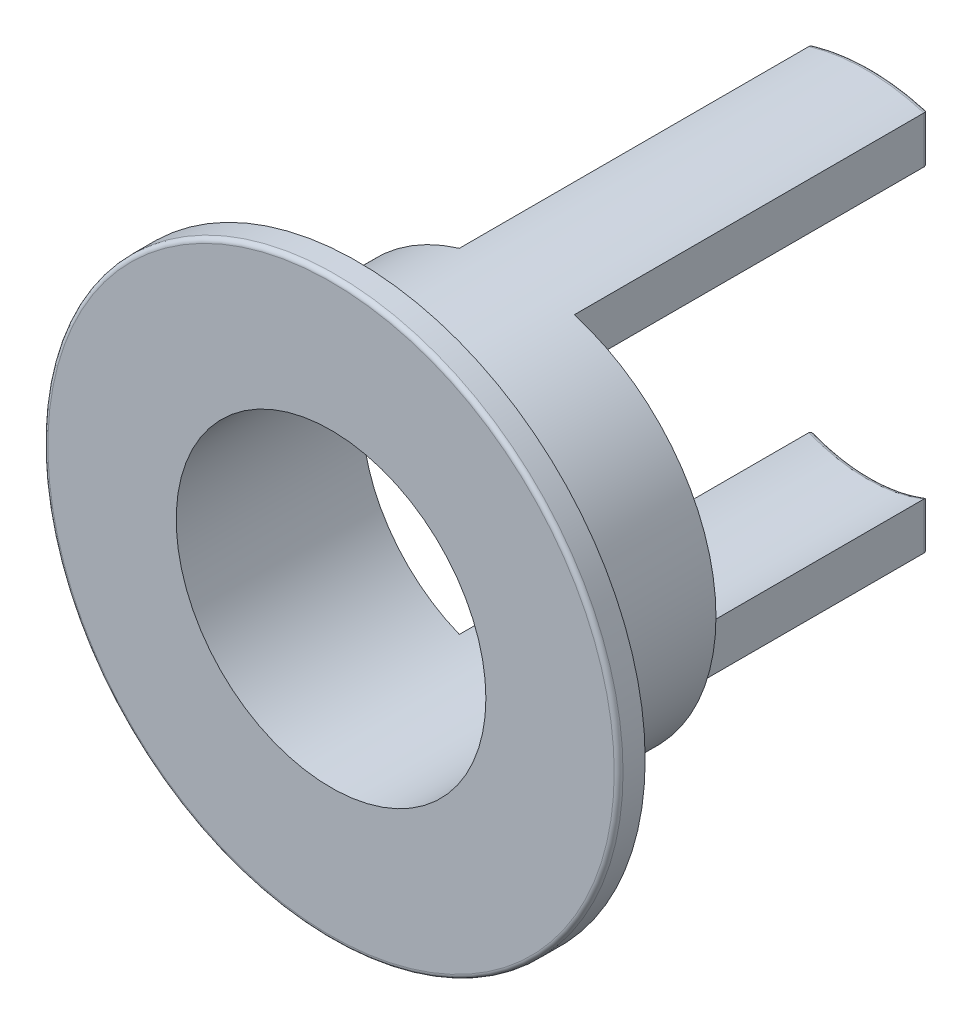
ISO-10303-21;
HEADER;
FILE_DESCRIPTION(('STEP AP214'),'2;1');
FILE_NAME('part.step','',(''),(''),'','','');
FILE_SCHEMA(('AUTOMOTIVE_DESIGN { 1 0 10303 214 1 1 1 1 }'));
ENDSEC;
DATA;
#1=APPLICATION_CONTEXT('core data for automotive mechanical design processes');
#2=APPLICATION_PROTOCOL_DEFINITION('international standard','automotive_design',2000,#1);
#3=PRODUCT_CONTEXT('',#1,'mechanical');
#4=PRODUCT('Part','Part','',(#3));
#5=PRODUCT_RELATED_PRODUCT_CATEGORY('part','',(#4));
#6=PRODUCT_DEFINITION_FORMATION('','',#4);
#7=PRODUCT_DEFINITION_CONTEXT('part definition',#1,'design');
#8=PRODUCT_DEFINITION('design','',#6,#7);
#9=PRODUCT_DEFINITION_SHAPE('','',#8);
#10=(LENGTH_UNIT() NAMED_UNIT(*) SI_UNIT(.MILLI.,.METRE.));
#11=(NAMED_UNIT(*) PLANE_ANGLE_UNIT() SI_UNIT($,.RADIAN.));
#12=(NAMED_UNIT(*) SI_UNIT($,.STERADIAN.) SOLID_ANGLE_UNIT());
#13=UNCERTAINTY_MEASURE_WITH_UNIT(LENGTH_MEASURE(1.E-05),#10,'distance_accuracy_value','');
#14=(GEOMETRIC_REPRESENTATION_CONTEXT(3) GLOBAL_UNCERTAINTY_ASSIGNED_CONTEXT((#13)) GLOBAL_UNIT_ASSIGNED_CONTEXT((#10,
#11,#12)) REPRESENTATION_CONTEXT('',''));
#15=CARTESIAN_POINT('',(0.,0.,0.));
#16=DIRECTION('',(0.,0.,1.));
#17=DIRECTION('',(1.,0.,0.));
#18=AXIS2_PLACEMENT_3D('',#15,#16,#17);
#19=CARTESIAN_POINT('',(0.,0.,0.3));
#20=DIRECTION('',(0.,0.,-1.));
#21=DIRECTION('',(-1.,0.,0.));
#22=AXIS2_PLACEMENT_3D('',#19,#20,#21);
#23=CYLINDRICAL_SURFACE('',#22,1.75);
#24=CARTESIAN_POINT('',(0.,0.,0.3));
#25=DIRECTION('',(0.,0.,1.));
#26=DIRECTION('',(1.,0.,0.));
#27=AXIS2_PLACEMENT_3D('',#24,#25,#26);
#28=CIRCLE('',#27,1.75);
#29=CARTESIAN_POINT('',(1.75,0.,0.3));
#30=VERTEX_POINT('',#29);
#31=EDGE_CURVE('E192',#30,#30,#28,.T.);
#32=ORIENTED_EDGE('',*,*,#31,.T.);
#33=EDGE_LOOP('',(#32));
#34=FACE_BOUND('',#33,.T.);
#35=DIRECTION('',(0.,0.,-1.));
#36=VECTOR('',#35,1.);
#37=CARTESIAN_POINT('',(0.65,-1.62480768092719,4.59565011723042));
#38=LINE('',#37,#36);
#39=CARTESIAN_POINT('',(0.65,-1.62480768092719,-1.8));
#40=VERTEX_POINT('',#39);
#41=CARTESIAN_POINT('',(0.65,-1.62480768092719,-5.75));
#42=VERTEX_POINT('',#41);
#43=EDGE_CURVE('E169',#40,#42,#38,.T.);
#44=ORIENTED_EDGE('',*,*,#43,.T.);
#45=CARTESIAN_POINT('',(0.,0.,-5.75));
#46=DIRECTION('',(0.,0.,1.));
#47=DIRECTION('',(1.,0.,0.));
#48=AXIS2_PLACEMENT_3D('',#45,#46,#47);
#49=CIRCLE('',#48,1.75);
#50=CARTESIAN_POINT('',(-0.65,-1.62480768092719,-5.75));
#51=VERTEX_POINT('',#50);
#52=EDGE_CURVE('E227',#42,#51,#49,.F.);
#53=ORIENTED_EDGE('',*,*,#52,.T.);
#54=DIRECTION('',(0.,0.,-1.));
#55=VECTOR('',#54,1.);
#56=CARTESIAN_POINT('',(-0.65,-1.62480768092719,4.59565011723042));
#57=LINE('',#56,#55);
#58=CARTESIAN_POINT('',(-0.65,-1.62480768092719,-1.8));
#59=VERTEX_POINT('',#58);
#60=EDGE_CURVE('E166',#59,#51,#57,.T.);
#61=ORIENTED_EDGE('',*,*,#60,.F.);
#62=CARTESIAN_POINT('',(0.,0.,-1.8));
#63=DIRECTION('',(0.,0.,1.));
#64=DIRECTION('',(1.,0.,0.));
#65=AXIS2_PLACEMENT_3D('',#62,#63,#64);
#66=CIRCLE('',#65,1.75);
#67=CARTESIAN_POINT('',(-0.65,1.62480768092719,-1.8));
#68=VERTEX_POINT('',#67);
#69=EDGE_CURVE('E159',#68,#59,#66,.T.);
#70=ORIENTED_EDGE('',*,*,#69,.F.);
#71=DIRECTION('',(0.,0.,-1.));
#72=VECTOR('',#71,1.);
#73=CARTESIAN_POINT('',(-0.65,1.62480768092719,4.59565011723042));
#74=LINE('',#73,#72);
#75=CARTESIAN_POINT('',(-0.65,1.62480768092719,-5.75));
#76=VERTEX_POINT('',#75);
#77=EDGE_CURVE('E142',#68,#76,#74,.T.);
#78=ORIENTED_EDGE('',*,*,#77,.T.);
#79=CARTESIAN_POINT('',(0.,0.,-5.75));
#80=DIRECTION('',(0.,0.,1.));
#81=DIRECTION('',(1.,0.,0.));
#82=AXIS2_PLACEMENT_3D('',#79,#80,#81);
#83=CIRCLE('',#82,1.75);
#84=CARTESIAN_POINT('',(0.65,1.62480768092719,-5.75));
#85=VERTEX_POINT('',#84);
#86=EDGE_CURVE('E67',#76,#85,#83,.F.);
#87=ORIENTED_EDGE('',*,*,#86,.T.);
#88=DIRECTION('',(0.,0.,-1.));
#89=VECTOR('',#88,1.);
#90=CARTESIAN_POINT('',(0.65,1.62480768092719,4.59565011723042));
#91=LINE('',#90,#89);
#92=CARTESIAN_POINT('',(0.65,1.62480768092719,-1.8));
#93=VERTEX_POINT('',#92);
#94=EDGE_CURVE('E178',#93,#85,#91,.T.);
#95=ORIENTED_EDGE('',*,*,#94,.F.);
#96=CARTESIAN_POINT('',(0.,0.,-1.8));
#97=DIRECTION('',(0.,0.,1.));
#98=DIRECTION('',(1.,0.,0.));
#99=AXIS2_PLACEMENT_3D('',#96,#97,#98);
#100=CIRCLE('',#99,1.75);
#101=EDGE_CURVE('E179',#40,#93,#100,.T.);
#102=ORIENTED_EDGE('',*,*,#101,.F.);
#103=EDGE_LOOP('',(#44,#53,#61,#70,#78,#87,#95,#102));
#104=FACE_BOUND('',#103,.T.);
#105=ADVANCED_FACE('F38',(#34,#104),#23,.F.);
#106=CARTESIAN_POINT('',(0.,0.,-5.8));
#107=DIRECTION('',(0.,0.,1.));
#108=DIRECTION('',(1.,0.,0.));
#109=AXIS2_PLACEMENT_3D('',#106,#107,#108);
#110=CYLINDRICAL_SURFACE('',#109,2.25);
#111=CARTESIAN_POINT('',(0.,0.,0.));
#112=DIRECTION('',(0.,0.,1.));
#113=DIRECTION('',(1.,0.,0.));
#114=AXIS2_PLACEMENT_3D('',#111,#112,#113);
#115=CIRCLE('',#114,2.25);
#116=CARTESIAN_POINT('',(2.25,0.,0.));
#117=VERTEX_POINT('',#116);
#118=EDGE_CURVE('E188',#117,#117,#115,.T.);
#119=ORIENTED_EDGE('',*,*,#118,.F.);
#120=EDGE_LOOP('',(#119));
#121=FACE_BOUND('',#120,.T.);
#122=DIRECTION('',(0.,0.,-1.));
#123=VECTOR('',#122,1.);
#124=CARTESIAN_POINT('',(-0.65,-2.1540659228538,4.59565011723042));
#125=LINE('',#124,#123);
#126=CARTESIAN_POINT('',(-0.65,-2.1540659228538,-1.8));
#127=VERTEX_POINT('',#126);
#128=CARTESIAN_POINT('',(-0.65,-2.1540659228538,-5.75));
#129=VERTEX_POINT('',#128);
#130=EDGE_CURVE('E163',#127,#129,#125,.T.);
#131=ORIENTED_EDGE('',*,*,#130,.T.);
#132=CARTESIAN_POINT('',(0.,0.,-5.75));
#133=DIRECTION('',(0.,0.,1.));
#134=DIRECTION('',(1.,0.,0.));
#135=AXIS2_PLACEMENT_3D('',#132,#133,#134);
#136=CIRCLE('',#135,2.25);
#137=CARTESIAN_POINT('',(0.65,-2.1540659228538,-5.75));
#138=VERTEX_POINT('',#137);
#139=EDGE_CURVE('E224',#129,#138,#136,.T.);
#140=ORIENTED_EDGE('',*,*,#139,.T.);
#141=DIRECTION('',(0.,0.,-1.));
#142=VECTOR('',#141,1.);
#143=CARTESIAN_POINT('',(0.65,-2.1540659228538,4.59565011723042));
#144=LINE('',#143,#142);
#145=CARTESIAN_POINT('',(0.65,-2.1540659228538,-1.8));
#146=VERTEX_POINT('',#145);
#147=EDGE_CURVE('E173',#146,#138,#144,.T.);
#148=ORIENTED_EDGE('',*,*,#147,.F.);
#149=CARTESIAN_POINT('',(0.,0.,-1.8));
#150=DIRECTION('',(0.,0.,1.));
#151=DIRECTION('',(1.,0.,0.));
#152=AXIS2_PLACEMENT_3D('',#149,#150,#151);
#153=CIRCLE('',#152,2.25);
#154=CARTESIAN_POINT('',(0.65,2.1540659228538,-1.8));
#155=VERTEX_POINT('',#154);
#156=EDGE_CURVE('E170',#155,#146,#153,.F.);
#157=ORIENTED_EDGE('',*,*,#156,.F.);
#158=DIRECTION('',(0.,0.,-1.));
#159=VECTOR('',#158,1.);
#160=CARTESIAN_POINT('',(0.65,2.1540659228538,4.59565011723042));
#161=LINE('',#160,#159);
#162=CARTESIAN_POINT('',(0.65,2.1540659228538,-5.75));
#163=VERTEX_POINT('',#162);
#164=EDGE_CURVE('E174',#155,#163,#161,.T.);
#165=ORIENTED_EDGE('',*,*,#164,.T.);
#166=CARTESIAN_POINT('',(0.,0.,-5.75));
#167=DIRECTION('',(0.,0.,1.));
#168=DIRECTION('',(1.,0.,0.));
#169=AXIS2_PLACEMENT_3D('',#166,#167,#168);
#170=CIRCLE('',#169,2.25);
#171=CARTESIAN_POINT('',(-0.65,2.1540659228538,-5.75));
#172=VERTEX_POINT('',#171);
#173=EDGE_CURVE('E157',#163,#172,#170,.T.);
#174=ORIENTED_EDGE('',*,*,#173,.T.);
#175=DIRECTION('',(0.,0.,-1.));
#176=VECTOR('',#175,1.);
#177=CARTESIAN_POINT('',(-0.65,2.1540659228538,4.59565011723042));
#178=LINE('',#177,#176);
#179=CARTESIAN_POINT('',(-0.65,2.1540659228538,-1.8));
#180=VERTEX_POINT('',#179);
#181=EDGE_CURVE('E140',#180,#172,#178,.T.);
#182=ORIENTED_EDGE('',*,*,#181,.F.);
#183=CARTESIAN_POINT('',(0.,0.,-1.8));
#184=DIRECTION('',(0.,0.,1.));
#185=DIRECTION('',(1.,0.,0.));
#186=AXIS2_PLACEMENT_3D('',#183,#184,#185);
#187=CIRCLE('',#186,2.25);
#188=EDGE_CURVE('E146',#127,#180,#187,.F.);
#189=ORIENTED_EDGE('',*,*,#188,.F.);
#190=EDGE_LOOP('',(#131,#140,#148,#157,#165,#174,#182,#189));
#191=FACE_BOUND('',#190,.T.);
#192=ADVANCED_FACE('F155',(#121,#191),#110,.T.);
#193=CARTESIAN_POINT('',(0.,0.,-5.8));
#194=DIRECTION('',(0.,0.,1.));
#195=DIRECTION('',(1.,0.,0.));
#196=AXIS2_PLACEMENT_3D('',#193,#194,#195);
#197=PLANE('',#196);
#198=DIRECTION('',(0.,1.,0.));
#199=VECTOR('',#198,1.);
#200=CARTESIAN_POINT('',(0.6,0.,-5.8));
#201=LINE('',#200,#199);
#202=CARTESIAN_POINT('',(0.6,2.11660104885167,-5.8));
#203=VERTEX_POINT('',#202);
#204=CARTESIAN_POINT('',(0.6,1.69705627484771,-5.8));
#205=VERTEX_POINT('',#204);
#206=EDGE_CURVE('E213',#203,#205,#201,.F.);
#207=ORIENTED_EDGE('',*,*,#206,.T.);
#208=CARTESIAN_POINT('',(0.,0.,-5.8));
#209=DIRECTION('',(0.,0.,1.));
#210=DIRECTION('',(1.,0.,0.));
#211=AXIS2_PLACEMENT_3D('',#208,#209,#210);
#212=CIRCLE('',#211,1.8);
#213=CARTESIAN_POINT('',(-0.6,1.69705627484771,-5.8));
#214=VERTEX_POINT('',#213);
#215=EDGE_CURVE('E218',#205,#214,#212,.T.);
#216=ORIENTED_EDGE('',*,*,#215,.T.);
#217=DIRECTION('',(0.,1.,0.));
#218=VECTOR('',#217,1.);
#219=CARTESIAN_POINT('',(-0.6,2.1540659228538,-5.8));
#220=LINE('',#219,#218);
#221=CARTESIAN_POINT('',(-0.6,2.11660104885167,-5.8));
#222=VERTEX_POINT('',#221);
#223=EDGE_CURVE('E215',#214,#222,#220,.T.);
#224=ORIENTED_EDGE('',*,*,#223,.T.);
#225=CARTESIAN_POINT('',(0.,0.,-5.8));
#226=DIRECTION('',(0.,0.,1.));
#227=DIRECTION('',(1.,0.,0.));
#228=AXIS2_PLACEMENT_3D('',#225,#226,#227);
#229=CIRCLE('',#228,2.2);
#230=EDGE_CURVE('E211',#222,#203,#229,.F.);
#231=ORIENTED_EDGE('',*,*,#230,.T.);
#232=EDGE_LOOP('',(#207,#216,#224,#231));
#233=FACE_BOUND('',#232,.T.);
#234=ADVANCED_FACE('F312',(#233),#197,.F.);
#235=DIRECTION('',(0.,1.,0.));
#236=VECTOR('',#235,1.);
#237=CARTESIAN_POINT('',(0.6,0.,-5.8));
#238=LINE('',#237,#236);
#239=CARTESIAN_POINT('',(0.6,-1.69705627484771,-5.8));
#240=VERTEX_POINT('',#239);
#241=CARTESIAN_POINT('',(0.6,-2.11660104885167,-5.8));
#242=VERTEX_POINT('',#241);
#243=EDGE_CURVE('E204',#240,#242,#238,.F.);
#244=ORIENTED_EDGE('',*,*,#243,.T.);
#245=CARTESIAN_POINT('',(0.,0.,-5.8));
#246=DIRECTION('',(0.,0.,1.));
#247=DIRECTION('',(1.,0.,0.));
#248=AXIS2_PLACEMENT_3D('',#245,#246,#247);
#249=CIRCLE('',#248,2.2);
#250=CARTESIAN_POINT('',(-0.6,-2.11660104885167,-5.8));
#251=VERTEX_POINT('',#250);
#252=EDGE_CURVE('E207',#242,#251,#249,.F.);
#253=ORIENTED_EDGE('',*,*,#252,.T.);
#254=DIRECTION('',(0.,1.,0.));
#255=VECTOR('',#254,1.);
#256=CARTESIAN_POINT('',(-0.6,-1.62480768092719,-5.8));
#257=LINE('',#256,#255);
#258=CARTESIAN_POINT('',(-0.6,-1.69705627484771,-5.8));
#259=VERTEX_POINT('',#258);
#260=EDGE_CURVE('E202',#251,#259,#257,.T.);
#261=ORIENTED_EDGE('',*,*,#260,.T.);
#262=CARTESIAN_POINT('',(0.,0.,-5.8));
#263=DIRECTION('',(0.,0.,1.));
#264=DIRECTION('',(1.,0.,0.));
#265=AXIS2_PLACEMENT_3D('',#262,#263,#264);
#266=CIRCLE('',#265,1.8);
#267=EDGE_CURVE('E200',#259,#240,#266,.T.);
#268=ORIENTED_EDGE('',*,*,#267,.T.);
#269=EDGE_LOOP('',(#244,#253,#261,#268));
#270=FACE_BOUND('',#269,.T.);
#271=ADVANCED_FACE('F321',(#270),#197,.F.);
#272=CARTESIAN_POINT('',(0.,0.,0.3));
#273=DIRECTION('',(0.,0.,-1.));
#274=DIRECTION('',(-1.,0.,0.));
#275=AXIS2_PLACEMENT_3D('',#272,#273,#274);
#276=CYLINDRICAL_SURFACE('',#275,3.25);
#277=CARTESIAN_POINT('',(0.,0.,0.25));
#278=DIRECTION('',(0.,0.,1.));
#279=DIRECTION('',(1.,0.,0.));
#280=AXIS2_PLACEMENT_3D('',#277,#278,#279);
#281=CIRCLE('',#280,3.25);
#282=CARTESIAN_POINT('',(3.25,0.,0.25));
#283=VERTEX_POINT('',#282);
#284=EDGE_CURVE('E13',#283,#283,#281,.F.);
#285=ORIENTED_EDGE('',*,*,#284,.T.);
#286=EDGE_LOOP('',(#285));
#287=FACE_BOUND('',#286,.T.);
#288=CARTESIAN_POINT('',(0.,0.,0.));
#289=DIRECTION('',(0.,0.,1.));
#290=DIRECTION('',(1.,0.,0.));
#291=AXIS2_PLACEMENT_3D('',#288,#289,#290);
#292=CIRCLE('',#291,3.25);
#293=CARTESIAN_POINT('',(3.25,0.,0.));
#294=VERTEX_POINT('',#293);
#295=EDGE_CURVE('E191',#294,#294,#292,.T.);
#296=ORIENTED_EDGE('',*,*,#295,.T.);
#297=EDGE_LOOP('',(#296));
#298=FACE_BOUND('',#297,.T.);
#299=ADVANCED_FACE('F318',(#287,#298),#276,.T.);
#300=CARTESIAN_POINT('',(0.,0.,0.3));
#301=DIRECTION('',(0.,0.,1.));
#302=DIRECTION('',(1.,0.,0.));
#303=AXIS2_PLACEMENT_3D('',#300,#301,#302);
#304=PLANE('',#303);
#305=CARTESIAN_POINT('',(0.,0.,0.3));
#306=DIRECTION('',(0.,0.,1.));
#307=DIRECTION('',(1.,0.,0.));
#308=AXIS2_PLACEMENT_3D('',#305,#306,#307);
#309=CIRCLE('',#308,3.2);
#310=CARTESIAN_POINT('',(3.2,0.,0.3));
#311=VERTEX_POINT('',#310);
#312=EDGE_CURVE('E51',#311,#311,#309,.T.);
#313=ORIENTED_EDGE('',*,*,#312,.T.);
#314=EDGE_LOOP('',(#313));
#315=FACE_BOUND('',#314,.T.);
#316=ORIENTED_EDGE('',*,*,#31,.F.);
#317=EDGE_LOOP('',(#316));
#318=FACE_BOUND('',#317,.T.);
#319=ADVANCED_FACE('F320',(#315,#318),#304,.T.);
#320=CARTESIAN_POINT('',(0.,0.,0.));
#321=DIRECTION('',(0.,0.,1.));
#322=DIRECTION('',(1.,0.,0.));
#323=AXIS2_PLACEMENT_3D('',#320,#321,#322);
#324=PLANE('',#323);
#325=ORIENTED_EDGE('',*,*,#118,.T.);
#326=EDGE_LOOP('',(#325));
#327=FACE_BOUND('',#326,.T.);
#328=ORIENTED_EDGE('',*,*,#295,.F.);
#329=EDGE_LOOP('',(#328));
#330=FACE_BOUND('',#329,.T.);
#331=ADVANCED_FACE('F316',(#327,#330),#324,.F.);
#332=CARTESIAN_POINT('',(0.,0.,-1.8));
#333=DIRECTION('',(0.,0.,1.));
#334=DIRECTION('',(1.,0.,0.));
#335=AXIS2_PLACEMENT_3D('',#332,#333,#334);
#336=PLANE('',#335);
#337=ORIENTED_EDGE('',*,*,#156,.T.);
#338=DIRECTION('',(0.,1.,0.));
#339=VECTOR('',#338,1.);
#340=CARTESIAN_POINT('',(0.65,0.,-1.8));
#341=LINE('',#340,#339);
#342=EDGE_CURVE('E165',#146,#40,#341,.T.);
#343=ORIENTED_EDGE('',*,*,#342,.T.);
#344=ORIENTED_EDGE('',*,*,#101,.T.);
#345=DIRECTION('',(0.,1.,0.));
#346=VECTOR('',#345,1.);
#347=CARTESIAN_POINT('',(0.65,0.,-1.8));
#348=LINE('',#347,#346);
#349=EDGE_CURVE('E175',#93,#155,#348,.T.);
#350=ORIENTED_EDGE('',*,*,#349,.T.);
#351=EDGE_LOOP('',(#337,#343,#344,#350));
#352=FACE_BOUND('',#351,.T.);
#353=ADVANCED_FACE('F335',(#352),#336,.F.);
#354=CARTESIAN_POINT('',(0.65,0.,4.59565011723042));
#355=DIRECTION('',(-1.,0.,0.));
#356=DIRECTION('',(0.,0.,1.));
#357=AXIS2_PLACEMENT_3D('',#354,#355,#356);
#358=PLANE('',#357);
#359=ORIENTED_EDGE('',*,*,#147,.T.);
#360=DIRECTION('',(0.,1.,0.));
#361=VECTOR('',#360,1.);
#362=CARTESIAN_POINT('',(0.65,0.,-5.75));
#363=LINE('',#362,#361);
#364=EDGE_CURVE('E195',#138,#42,#363,.T.);
#365=ORIENTED_EDGE('',*,*,#364,.T.);
#366=ORIENTED_EDGE('',*,*,#43,.F.);
#367=ORIENTED_EDGE('',*,*,#342,.F.);
#368=EDGE_LOOP('',(#359,#365,#366,#367));
#369=FACE_BOUND('',#368,.T.);
#370=ADVANCED_FACE('F340',(#369),#358,.F.);
#371=ORIENTED_EDGE('',*,*,#94,.T.);
#372=DIRECTION('',(0.,1.,0.));
#373=VECTOR('',#372,1.);
#374=CARTESIAN_POINT('',(0.65,0.,-5.75));
#375=LINE('',#374,#373);
#376=EDGE_CURVE('E59',#85,#163,#375,.T.);
#377=ORIENTED_EDGE('',*,*,#376,.T.);
#378=ORIENTED_EDGE('',*,*,#164,.F.);
#379=ORIENTED_EDGE('',*,*,#349,.F.);
#380=EDGE_LOOP('',(#371,#377,#378,#379));
#381=FACE_BOUND('',#380,.T.);
#382=ADVANCED_FACE('F347',(#381),#358,.F.);
#383=CARTESIAN_POINT('',(0.,0.,-1.8));
#384=DIRECTION('',(0.,0.,1.));
#385=DIRECTION('',(1.,0.,0.));
#386=AXIS2_PLACEMENT_3D('',#383,#384,#385);
#387=PLANE('',#386);
#388=ORIENTED_EDGE('',*,*,#188,.T.);
#389=DIRECTION('',(0.,1.,0.));
#390=VECTOR('',#389,1.);
#391=CARTESIAN_POINT('',(-0.65,0.,-1.8));
#392=LINE('',#391,#390);
#393=EDGE_CURVE('E135',#68,#180,#392,.T.);
#394=ORIENTED_EDGE('',*,*,#393,.F.);
#395=ORIENTED_EDGE('',*,*,#69,.T.);
#396=DIRECTION('',(0.,1.,0.));
#397=VECTOR('',#396,1.);
#398=CARTESIAN_POINT('',(-0.65,0.,-1.8));
#399=LINE('',#398,#397);
#400=EDGE_CURVE('E147',#127,#59,#399,.T.);
#401=ORIENTED_EDGE('',*,*,#400,.F.);
#402=EDGE_LOOP('',(#388,#394,#395,#401));
#403=FACE_BOUND('',#402,.T.);
#404=ADVANCED_FACE('F150',(#403),#387,.F.);
#405=CARTESIAN_POINT('',(-0.65,0.,4.59565011723042));
#406=DIRECTION('',(-1.,0.,0.));
#407=DIRECTION('',(0.,0.,1.));
#408=AXIS2_PLACEMENT_3D('',#405,#406,#407);
#409=PLANE('',#408);
#410=ORIENTED_EDGE('',*,*,#181,.T.);
#411=DIRECTION('',(0.,1.,0.));
#412=VECTOR('',#411,1.);
#413=CARTESIAN_POINT('',(-0.65,1.62480768092719,-5.75));
#414=LINE('',#413,#412);
#415=EDGE_CURVE('E220',#172,#76,#414,.F.);
#416=ORIENTED_EDGE('',*,*,#415,.T.);
#417=ORIENTED_EDGE('',*,*,#77,.F.);
#418=ORIENTED_EDGE('',*,*,#393,.T.);
#419=EDGE_LOOP('',(#410,#416,#417,#418));
#420=FACE_BOUND('',#419,.T.);
#421=ADVANCED_FACE('F137',(#420),#409,.T.);
#422=ORIENTED_EDGE('',*,*,#60,.T.);
#423=DIRECTION('',(0.,1.,0.));
#424=VECTOR('',#423,1.);
#425=CARTESIAN_POINT('',(-0.65,-2.1540659228538,-5.75));
#426=LINE('',#425,#424);
#427=EDGE_CURVE('E209',#51,#129,#426,.F.);
#428=ORIENTED_EDGE('',*,*,#427,.T.);
#429=ORIENTED_EDGE('',*,*,#130,.F.);
#430=ORIENTED_EDGE('',*,*,#400,.T.);
#431=EDGE_LOOP('',(#422,#428,#429,#430));
#432=FACE_BOUND('',#431,.T.);
#433=ADVANCED_FACE('F369',(#432),#409,.T.);
#434=CARTESIAN_POINT('',(-0.6,0.,-5.75));
#435=DIRECTION('',(0.,-1.,0.));
#436=DIRECTION('',(0.,0.,-1.));
#437=AXIS2_PLACEMENT_3D('',#434,#435,#436);
#438=CYLINDRICAL_SURFACE('',#437,0.05);
#439=CARTESIAN_POINT('',(-0.65,-1.62480768092719,-5.75));
#440=CARTESIAN_POINT('',(-0.650002233057553,-1.62480433482016,-5.7516787158368));
#441=CARTESIAN_POINT('',(-0.649915589084396,-1.6249323658797,-5.75335300265134));
#442=CARTESIAN_POINT('',(-0.64958419860094,-1.62542177450629,-5.75663666928263));
#443=CARTESIAN_POINT('',(-0.64934083951503,-1.62578110433604,-5.75824648826612));
#444=CARTESIAN_POINT('',(-0.648716004087327,-1.62670322329939,-5.76137124111905));
#445=CARTESIAN_POINT('',(-0.648334944221452,-1.62726539891847,-5.7628864451151));
#446=CARTESIAN_POINT('',(-0.647458814080341,-1.62855706559347,-5.76581121833043));
#447=CARTESIAN_POINT('',(-0.646963477132145,-1.62928694798762,-5.76722053008318));
#448=CARTESIAN_POINT('',(-0.64551124999802,-1.63142507495499,-5.77085082131399));
#449=CARTESIAN_POINT('',(-0.644470655487162,-1.63295546645925,-5.77296632761452));
#450=CARTESIAN_POINT('',(-0.642216549375548,-1.63626505739626,-5.77688674262357));
#451=CARTESIAN_POINT('',(-0.641002568507191,-1.63804493179941,-5.77869077807703));
#452=CARTESIAN_POINT('',(-0.63761958934003,-1.6429958650266,-5.78311934915719));
#453=CARTESIAN_POINT('',(-0.635347895979057,-1.64631155897872,-5.78550245845833));
#454=CARTESIAN_POINT('',(-0.630621597315092,-1.65318732208391,-5.78965089160063));
#455=CARTESIAN_POINT('',(-0.628166507567255,-1.65674803635822,-5.79141450362987));
#456=CARTESIAN_POINT('',(-0.621698052932469,-1.6660978001891,-5.79528278546759));
#457=CARTESIAN_POINT('',(-0.617601334635775,-1.67198949343879,-5.79699921553311));
#458=CARTESIAN_POINT('',(-0.609287480604971,-1.68388109054915,-5.79931792716036));
#459=CARTESIAN_POINT('',(-0.605070557933227,-1.68988079675183,-5.79992206902521));
#460=CARTESIAN_POINT('',(-0.600560518494967,-1.69626344406961,-5.79999762561035));
#461=CARTESIAN_POINT('',(-0.600280280280358,-1.69665989976755,-5.79999997966716));
#462=CARTESIAN_POINT('',(-0.6,-1.69705627484771,-5.8));
#463=B_SPLINE_CURVE_WITH_KNOTS('',3,(#439,#440,#441,#442,#443,#444,#445,#446,#447,#448,#449,
#450,#451,#452,#453,#454,#455,#456,#457,#458,#459,#460,#461,#462),.UNSPECIFIED.,.F.,.F.,(4,2,2,
2,2,2,2,2,2,2,2,4),(0.,0.00502200498451926,0.0100001494327994,0.0149633618046246,
0.0199382754483709,0.0283218105751439,0.0367284814137069,0.0506680024012653,0.0646457439339382,
0.0866710661295457,0.108659517370724,0.110116009856978),.UNSPECIFIED.);
#464=EDGE_CURVE('E269',#259,#51,#463,.F.);
#465=ORIENTED_EDGE('',*,*,#464,.F.);
#466=ORIENTED_EDGE('',*,*,#260,.F.);
#467=CARTESIAN_POINT('',(-0.65,-2.1540659228538,-5.75));
#468=CARTESIAN_POINT('',(-0.650003569910737,-2.15406853174046,-5.75242080661335));
#469=CARTESIAN_POINT('',(-0.649824448993362,-2.1539355274034,-5.75483773487414));
#470=CARTESIAN_POINT('',(-0.649130515955417,-2.15342001580703,-5.75958156745194));
#471=CARTESIAN_POINT('',(-0.648617678715408,-2.15303897637587,-5.76190891660127));
#472=CARTESIAN_POINT('',(-0.647286397480341,-2.15204941850969,-5.76641789198175));
#473=CARTESIAN_POINT('',(-0.646468417797248,-2.15144124568463,-5.76859973370481));
#474=CARTESIAN_POINT('',(-0.64456903711408,-2.15002823712415,-5.77277878503321));
#475=CARTESIAN_POINT('',(-0.643487301453773,-2.14922315153679,-5.77477575559274));
#476=CARTESIAN_POINT('',(-0.641022918129143,-2.14738776971228,-5.77868495194092));
#477=CARTESIAN_POINT('',(-0.639624604274521,-2.14634572676212,-5.78058169528575));
#478=CARTESIAN_POINT('',(-0.636630427765963,-2.14411254771953,-5.78411119529618));
#479=CARTESIAN_POINT('',(-0.63503451854285,-2.14292137647988,-5.78574388952091));
#480=CARTESIAN_POINT('',(-0.631375426799471,-2.14018773995637,-5.78902172116259));
#481=CARTESIAN_POINT('',(-0.629280767415177,-2.13862130647472,-5.79061165223892));
#482=CARTESIAN_POINT('',(-0.624936584894852,-2.13536875607808,-5.79341500263762));
#483=CARTESIAN_POINT('',(-0.622686885421559,-2.13368250281418,-5.79462798429897));
#484=CARTESIAN_POINT('',(-0.617620691116837,-2.12988039788868,-5.79689008538039));
#485=CARTESIAN_POINT('',(-0.614781230497288,-2.12774637472825,-5.79785712792052));
#486=CARTESIAN_POINT('',(-0.609027967499405,-2.12341568607259,-5.79926713332983));
#487=CARTESIAN_POINT('',(-0.606114284156815,-2.12121912028756,-5.79971088727384));
#488=CARTESIAN_POINT('',(-0.602513645002491,-2.11850039684498,-5.79994144396251));
#489=CARTESIAN_POINT('',(-0.60183201105538,-2.1179855291472,-5.79997108182817));
#490=CARTESIAN_POINT('',(-0.600766862656562,-2.11718068286754,-5.79999558831235));
#491=CARTESIAN_POINT('',(-0.600383435667305,-2.11689089879015,-5.79999999695756));
#492=CARTESIAN_POINT('',(-0.6,-2.11660104885167,-5.8));
#493=B_SPLINE_CURVE_WITH_KNOTS('',3,(#467,#468,#469,#470,#471,#472,#473,#474,#475,#476,#477,
#478,#479,#480,#481,#482,#483,#484,#485,#486,#487,#488,#489,#490,#491,#492),.UNSPECIFIED.,.F.,
.F.,(4,2,2,2,2,2,2,2,2,2,2,2,4),(0.,0.00724603656513178,0.0144495774809038,0.0216422017335893,
0.0288440000990643,0.0365452654561677,0.0442483493109765,0.0533975586026538,0.0625573513287596,
0.073560158312821,0.0845463105335739,0.0871103279323668,0.0885521946808707),.UNSPECIFIED.);
#494=EDGE_CURVE('E263',#129,#251,#493,.T.);
#495=ORIENTED_EDGE('',*,*,#494,.F.);
#496=ORIENTED_EDGE('',*,*,#427,.F.);
#497=EDGE_LOOP('',(#465,#466,#495,#496));
#498=FACE_BOUND('',#497,.T.);
#499=ADVANCED_FACE('F257',(#498),#438,.T.);
#500=CARTESIAN_POINT('',(0.,0.,-5.75));
#501=DIRECTION('',(0.,0.,1.));
#502=DIRECTION('',(1.,0.,0.));
#503=AXIS2_PLACEMENT_3D('',#500,#501,#502);
#504=TOROIDAL_SURFACE('',#503,2.2,0.05);
#505=ORIENTED_EDGE('',*,*,#494,.T.);
#506=ORIENTED_EDGE('',*,*,#252,.F.);
#507=CARTESIAN_POINT('',(0.65,-2.1540659228538,-5.75));
#508=CARTESIAN_POINT('',(0.650003569910737,-2.15406853174046,-5.75242080661335));
#509=CARTESIAN_POINT('',(0.649824448993362,-2.1539355274034,-5.75483773487414));
#510=CARTESIAN_POINT('',(0.649130515955417,-2.15342001580703,-5.75958156745194));
#511=CARTESIAN_POINT('',(0.648617678715408,-2.15303897637587,-5.76190891660127));
#512=CARTESIAN_POINT('',(0.647286397480341,-2.15204941850969,-5.76641789198175));
#513=CARTESIAN_POINT('',(0.646468417797248,-2.15144124568463,-5.76859973370481));
#514=CARTESIAN_POINT('',(0.64456903711408,-2.15002823712415,-5.77277878503321));
#515=CARTESIAN_POINT('',(0.643487301453773,-2.14922315153679,-5.77477575559274));
#516=CARTESIAN_POINT('',(0.641022918129143,-2.14738776971228,-5.77868495194092));
#517=CARTESIAN_POINT('',(0.639624604274521,-2.14634572676212,-5.78058169528575));
#518=CARTESIAN_POINT('',(0.636630427765963,-2.14411254771953,-5.78411119529618));
#519=CARTESIAN_POINT('',(0.63503451854285,-2.14292137647988,-5.78574388952091));
#520=CARTESIAN_POINT('',(0.631375426799471,-2.14018773995637,-5.78902172116259));
#521=CARTESIAN_POINT('',(0.629280767415177,-2.13862130647472,-5.79061165223892));
#522=CARTESIAN_POINT('',(0.624936584894852,-2.13536875607808,-5.79341500263762));
#523=CARTESIAN_POINT('',(0.622686885421559,-2.13368250281418,-5.79462798429897));
#524=CARTESIAN_POINT('',(0.617620691116837,-2.12988039788868,-5.79689008538039));
#525=CARTESIAN_POINT('',(0.614781230497288,-2.12774637472825,-5.79785712792052));
#526=CARTESIAN_POINT('',(0.609027967499405,-2.12341568607259,-5.79926713332983));
#527=CARTESIAN_POINT('',(0.606114284156815,-2.12121912028756,-5.79971088727384));
#528=CARTESIAN_POINT('',(0.602513645002491,-2.11850039684498,-5.79994144396251));
#529=CARTESIAN_POINT('',(0.60183201105538,-2.1179855291472,-5.79997108182817));
#530=CARTESIAN_POINT('',(0.600766862656562,-2.11718068286754,-5.79999558831235));
#531=CARTESIAN_POINT('',(0.600383435667305,-2.11689089879015,-5.79999999695756));
#532=CARTESIAN_POINT('',(0.6,-2.11660104885167,-5.8));
#533=B_SPLINE_CURVE_WITH_KNOTS('',3,(#507,#508,#509,#510,#511,#512,#513,#514,#515,#516,#517,
#518,#519,#520,#521,#522,#523,#524,#525,#526,#527,#528,#529,#530,#531,#532),.UNSPECIFIED.,.F.,
.F.,(4,2,2,2,2,2,2,2,2,2,2,2,4),(0.,0.00724603656513178,0.0144495774809038,0.0216422017335893,
0.0288440000990643,0.0365452654561677,0.0442483493109765,0.0533975586026538,0.0625573513287596,
0.073560158312821,0.0845463105335739,0.0871103279323668,0.0885521946808707),.UNSPECIFIED.);
#534=EDGE_CURVE('E238',#138,#242,#533,.T.);
#535=ORIENTED_EDGE('',*,*,#534,.F.);
#536=ORIENTED_EDGE('',*,*,#139,.F.);
#537=EDGE_LOOP('',(#505,#506,#535,#536));
#538=FACE_BOUND('',#537,.T.);
#539=ADVANCED_FACE('F252',(#538),#504,.T.);
#540=CARTESIAN_POINT('',(0.,0.,-5.75));
#541=DIRECTION('',(0.,0.,1.));
#542=DIRECTION('',(1.,0.,0.));
#543=AXIS2_PLACEMENT_3D('',#540,#541,#542);
#544=TOROIDAL_SURFACE('',#543,1.8,0.05);
#545=ORIENTED_EDGE('',*,*,#464,.T.);
#546=ORIENTED_EDGE('',*,*,#52,.F.);
#547=CARTESIAN_POINT('',(0.65,-1.62480768092719,-5.75));
#548=CARTESIAN_POINT('',(0.650002233057553,-1.62480433482016,-5.7516787158368));
#549=CARTESIAN_POINT('',(0.649915589084396,-1.6249323658797,-5.75335300265134));
#550=CARTESIAN_POINT('',(0.64958419860094,-1.62542177450629,-5.75663666928263));
#551=CARTESIAN_POINT('',(0.64934083951503,-1.62578110433604,-5.75824648826612));
#552=CARTESIAN_POINT('',(0.648716004087327,-1.62670322329939,-5.76137124111905));
#553=CARTESIAN_POINT('',(0.648334944221452,-1.62726539891847,-5.7628864451151));
#554=CARTESIAN_POINT('',(0.647458814080341,-1.62855706559347,-5.76581121833043));
#555=CARTESIAN_POINT('',(0.646963477132145,-1.62928694798762,-5.76722053008318));
#556=CARTESIAN_POINT('',(0.64551124999802,-1.63142507495499,-5.77085082131399));
#557=CARTESIAN_POINT('',(0.644470655487162,-1.63295546645925,-5.77296632761452));
#558=CARTESIAN_POINT('',(0.642216549375548,-1.63626505739626,-5.77688674262357));
#559=CARTESIAN_POINT('',(0.641002568507191,-1.63804493179941,-5.77869077807703));
#560=CARTESIAN_POINT('',(0.63761958934003,-1.6429958650266,-5.78311934915719));
#561=CARTESIAN_POINT('',(0.635347895979057,-1.64631155897872,-5.78550245845833));
#562=CARTESIAN_POINT('',(0.630621597315092,-1.65318732208391,-5.78965089160063));
#563=CARTESIAN_POINT('',(0.628166507567255,-1.65674803635822,-5.79141450362987));
#564=CARTESIAN_POINT('',(0.621698052932469,-1.6660978001891,-5.79528278546759));
#565=CARTESIAN_POINT('',(0.617601334635775,-1.67198949343879,-5.79699921553311));
#566=CARTESIAN_POINT('',(0.609287480604971,-1.68388109054915,-5.79931792716036));
#567=CARTESIAN_POINT('',(0.605070557933227,-1.68988079675183,-5.79992206902521));
#568=CARTESIAN_POINT('',(0.600560518494967,-1.69626344406961,-5.79999762561035));
#569=CARTESIAN_POINT('',(0.600280280280358,-1.69665989976755,-5.79999997966716));
#570=CARTESIAN_POINT('',(0.6,-1.69705627484771,-5.8));
#571=B_SPLINE_CURVE_WITH_KNOTS('',3,(#547,#548,#549,#550,#551,#552,#553,#554,#555,#556,#557,
#558,#559,#560,#561,#562,#563,#564,#565,#566,#567,#568,#569,#570),.UNSPECIFIED.,.F.,.F.,(4,2,2,
2,2,2,2,2,2,2,2,4),(0.,0.00502200498451926,0.0100001494327994,0.0149633618046246,
0.0199382754483709,0.0283218105751439,0.0367284814137069,0.0506680024012653,0.0646457439339382,
0.0866710661295457,0.108659517370724,0.110116009856978),.UNSPECIFIED.);
#572=EDGE_CURVE('E231',#240,#42,#571,.F.);
#573=ORIENTED_EDGE('',*,*,#572,.F.);
#574=ORIENTED_EDGE('',*,*,#267,.F.);
#575=EDGE_LOOP('',(#545,#546,#573,#574));
#576=FACE_BOUND('',#575,.T.);
#577=ADVANCED_FACE('F244',(#576),#544,.T.);
#578=CARTESIAN_POINT('',(0.6,0.,-5.75));
#579=DIRECTION('',(0.,1.,0.));
#580=DIRECTION('',(0.,0.,1.));
#581=AXIS2_PLACEMENT_3D('',#578,#579,#580);
#582=CYLINDRICAL_SURFACE('',#581,0.05);
#583=ORIENTED_EDGE('',*,*,#534,.T.);
#584=ORIENTED_EDGE('',*,*,#243,.F.);
#585=ORIENTED_EDGE('',*,*,#572,.T.);
#586=ORIENTED_EDGE('',*,*,#364,.F.);
#587=EDGE_LOOP('',(#583,#584,#585,#586));
#588=FACE_BOUND('',#587,.T.);
#589=ADVANCED_FACE('F247',(#588),#582,.T.);
#590=CARTESIAN_POINT('',(0.6,0.,-5.75));
#591=DIRECTION('',(0.,1.,0.));
#592=DIRECTION('',(0.,0.,1.));
#593=AXIS2_PLACEMENT_3D('',#590,#591,#592);
#594=CYLINDRICAL_SURFACE('',#593,0.05);
#595=CARTESIAN_POINT('',(0.65,2.1540659228538,-5.75));
#596=CARTESIAN_POINT('',(0.650003569910737,2.15406853174046,-5.75242080661335));
#597=CARTESIAN_POINT('',(0.649824448993362,2.1539355274034,-5.75483773487414));
#598=CARTESIAN_POINT('',(0.649130515955417,2.15342001580703,-5.75958156745194));
#599=CARTESIAN_POINT('',(0.648617678715408,2.15303897637587,-5.76190891660127));
#600=CARTESIAN_POINT('',(0.647286397480341,2.15204941850969,-5.76641789198175));
#601=CARTESIAN_POINT('',(0.646468417797248,2.15144124568463,-5.76859973370481));
#602=CARTESIAN_POINT('',(0.64456903711408,2.15002823712415,-5.77277878503321));
#603=CARTESIAN_POINT('',(0.643487301453773,2.14922315153679,-5.77477575559274));
#604=CARTESIAN_POINT('',(0.641022918129143,2.14738776971228,-5.77868495194092));
#605=CARTESIAN_POINT('',(0.639624604274521,2.14634572676212,-5.78058169528575));
#606=CARTESIAN_POINT('',(0.636630427765963,2.14411254771953,-5.78411119529618));
#607=CARTESIAN_POINT('',(0.63503451854285,2.14292137647988,-5.78574388952091));
#608=CARTESIAN_POINT('',(0.631375426799471,2.14018773995637,-5.78902172116259));
#609=CARTESIAN_POINT('',(0.629280767415177,2.13862130647472,-5.79061165223892));
#610=CARTESIAN_POINT('',(0.624936584894852,2.13536875607808,-5.79341500263762));
#611=CARTESIAN_POINT('',(0.622686885421559,2.13368250281418,-5.79462798429897));
#612=CARTESIAN_POINT('',(0.617620691116837,2.12988039788868,-5.79689008538039));
#613=CARTESIAN_POINT('',(0.614781230497288,2.12774637472825,-5.79785712792052));
#614=CARTESIAN_POINT('',(0.609027967499405,2.12341568607259,-5.79926713332983));
#615=CARTESIAN_POINT('',(0.606114284156815,2.12121912028756,-5.79971088727384));
#616=CARTESIAN_POINT('',(0.602513645002491,2.11850039684498,-5.79994144396251));
#617=CARTESIAN_POINT('',(0.60183201105538,2.1179855291472,-5.79997108182817));
#618=CARTESIAN_POINT('',(0.600766862656562,2.11718068286754,-5.79999558831235));
#619=CARTESIAN_POINT('',(0.600383435667305,2.11689089879015,-5.79999999695756));
#620=CARTESIAN_POINT('',(0.6,2.11660104885167,-5.8));
#621=B_SPLINE_CURVE_WITH_KNOTS('',3,(#595,#596,#597,#598,#599,#600,#601,#602,#603,#604,#605,
#606,#607,#608,#609,#610,#611,#612,#613,#614,#615,#616,#617,#618,#619,#620),.UNSPECIFIED.,.F.,
.F.,(4,2,2,2,2,2,2,2,2,2,2,2,4),(0.,0.00724603656513178,0.0144495774809038,0.0216422017335893,
0.0288440000990643,0.0365452654561677,0.0442483493109765,0.0533975586026538,0.0625573513287596,
0.073560158312821,0.0845463105335739,0.0871103279323668,0.0885521946808707),.UNSPECIFIED.);
#622=EDGE_CURVE('E292',#163,#203,#621,.T.);
#623=ORIENTED_EDGE('',*,*,#622,.F.);
#624=ORIENTED_EDGE('',*,*,#376,.F.);
#625=CARTESIAN_POINT('',(0.65,1.62480768092719,-5.75));
#626=CARTESIAN_POINT('',(0.650002233057553,1.62480433482016,-5.7516787158368));
#627=CARTESIAN_POINT('',(0.649915589084396,1.6249323658797,-5.75335300265134));
#628=CARTESIAN_POINT('',(0.64958419860094,1.62542177450629,-5.75663666928263));
#629=CARTESIAN_POINT('',(0.64934083951503,1.62578110433604,-5.75824648826612));
#630=CARTESIAN_POINT('',(0.648716004087327,1.62670322329939,-5.76137124111905));
#631=CARTESIAN_POINT('',(0.648334944221452,1.62726539891847,-5.7628864451151));
#632=CARTESIAN_POINT('',(0.647458814080341,1.62855706559347,-5.76581121833043));
#633=CARTESIAN_POINT('',(0.646963477132145,1.62928694798762,-5.76722053008318));
#634=CARTESIAN_POINT('',(0.64551124999802,1.63142507495499,-5.77085082131399));
#635=CARTESIAN_POINT('',(0.644470655487162,1.63295546645925,-5.77296632761452));
#636=CARTESIAN_POINT('',(0.642216549375548,1.63626505739626,-5.77688674262357));
#637=CARTESIAN_POINT('',(0.641002568507191,1.63804493179941,-5.77869077807703));
#638=CARTESIAN_POINT('',(0.63761958934003,1.6429958650266,-5.78311934915719));
#639=CARTESIAN_POINT('',(0.635347895979057,1.64631155897872,-5.78550245845833));
#640=CARTESIAN_POINT('',(0.630621597315092,1.65318732208391,-5.78965089160063));
#641=CARTESIAN_POINT('',(0.628166507567255,1.65674803635822,-5.79141450362987));
#642=CARTESIAN_POINT('',(0.621698052932469,1.6660978001891,-5.79528278546759));
#643=CARTESIAN_POINT('',(0.617601334635775,1.67198949343879,-5.79699921553311));
#644=CARTESIAN_POINT('',(0.609287480604971,1.68388109054915,-5.79931792716036));
#645=CARTESIAN_POINT('',(0.605070557933227,1.68988079675183,-5.79992206902521));
#646=CARTESIAN_POINT('',(0.600560518494967,1.69626344406961,-5.79999762561035));
#647=CARTESIAN_POINT('',(0.600280280280358,1.69665989976755,-5.79999997966716));
#648=CARTESIAN_POINT('',(0.6,1.69705627484771,-5.8));
#649=B_SPLINE_CURVE_WITH_KNOTS('',3,(#625,#626,#627,#628,#629,#630,#631,#632,#633,#634,#635,
#636,#637,#638,#639,#640,#641,#642,#643,#644,#645,#646,#647,#648),.UNSPECIFIED.,.F.,.F.,(4,2,2,
2,2,2,2,2,2,2,2,4),(0.,0.00502200498451926,0.0100001494327994,0.0149633618046246,
0.0199382754483709,0.0283218105751439,0.0367284814137069,0.0506680024012653,0.0646457439339382,
0.0866710661295457,0.108659517370724,0.110116009856978),.UNSPECIFIED.);
#650=EDGE_CURVE('E42',#205,#85,#649,.F.);
#651=ORIENTED_EDGE('',*,*,#650,.F.);
#652=ORIENTED_EDGE('',*,*,#206,.F.);
#653=EDGE_LOOP('',(#623,#624,#651,#652));
#654=FACE_BOUND('',#653,.T.);
#655=ADVANCED_FACE('F250',(#654),#594,.T.);
#656=CARTESIAN_POINT('',(0.,0.,-5.75));
#657=DIRECTION('',(0.,0.,1.));
#658=DIRECTION('',(1.,0.,0.));
#659=AXIS2_PLACEMENT_3D('',#656,#657,#658);
#660=TOROIDAL_SURFACE('',#659,1.8,0.05);
#661=ORIENTED_EDGE('',*,*,#650,.T.);
#662=ORIENTED_EDGE('',*,*,#86,.F.);
#663=CARTESIAN_POINT('',(-0.65,1.62480768092719,-5.75));
#664=CARTESIAN_POINT('',(-0.650002233057553,1.62480433482016,-5.7516787158368));
#665=CARTESIAN_POINT('',(-0.649915589084396,1.6249323658797,-5.75335300265134));
#666=CARTESIAN_POINT('',(-0.64958419860094,1.62542177450629,-5.75663666928263));
#667=CARTESIAN_POINT('',(-0.64934083951503,1.62578110433604,-5.75824648826612));
#668=CARTESIAN_POINT('',(-0.648716004087327,1.62670322329939,-5.76137124111905));
#669=CARTESIAN_POINT('',(-0.648334944221452,1.62726539891847,-5.7628864451151));
#670=CARTESIAN_POINT('',(-0.647458814080341,1.62855706559347,-5.76581121833043));
#671=CARTESIAN_POINT('',(-0.646963477132145,1.62928694798762,-5.76722053008318));
#672=CARTESIAN_POINT('',(-0.64551124999802,1.63142507495499,-5.77085082131399));
#673=CARTESIAN_POINT('',(-0.644470655487162,1.63295546645925,-5.77296632761452));
#674=CARTESIAN_POINT('',(-0.642216549375548,1.63626505739626,-5.77688674262357));
#675=CARTESIAN_POINT('',(-0.641002568507191,1.63804493179941,-5.77869077807703));
#676=CARTESIAN_POINT('',(-0.63761958934003,1.6429958650266,-5.78311934915719));
#677=CARTESIAN_POINT('',(-0.635347895979057,1.64631155897872,-5.78550245845833));
#678=CARTESIAN_POINT('',(-0.630621597315092,1.65318732208391,-5.78965089160063));
#679=CARTESIAN_POINT('',(-0.628166507567255,1.65674803635822,-5.79141450362987));
#680=CARTESIAN_POINT('',(-0.621698052932469,1.6660978001891,-5.79528278546759));
#681=CARTESIAN_POINT('',(-0.617601334635775,1.67198949343879,-5.79699921553311));
#682=CARTESIAN_POINT('',(-0.609287480604971,1.68388109054915,-5.79931792716036));
#683=CARTESIAN_POINT('',(-0.605070557933227,1.68988079675183,-5.79992206902521));
#684=CARTESIAN_POINT('',(-0.600560518494967,1.69626344406961,-5.79999762561035));
#685=CARTESIAN_POINT('',(-0.600280280280358,1.69665989976755,-5.79999997966716));
#686=CARTESIAN_POINT('',(-0.6,1.69705627484771,-5.8));
#687=B_SPLINE_CURVE_WITH_KNOTS('',3,(#663,#664,#665,#666,#667,#668,#669,#670,#671,#672,#673,
#674,#675,#676,#677,#678,#679,#680,#681,#682,#683,#684,#685,#686),.UNSPECIFIED.,.F.,.F.,(4,2,2,
2,2,2,2,2,2,2,2,4),(0.,0.00502200498451926,0.0100001494327994,0.0149633618046246,
0.0199382754483709,0.0283218105751439,0.0367284814137069,0.0506680024012653,0.0646457439339382,
0.0866710661295457,0.108659517370724,0.110116009856978),.UNSPECIFIED.);
#688=EDGE_CURVE('E279',#214,#76,#687,.F.);
#689=ORIENTED_EDGE('',*,*,#688,.F.);
#690=ORIENTED_EDGE('',*,*,#215,.F.);
#691=EDGE_LOOP('',(#661,#662,#689,#690));
#692=FACE_BOUND('',#691,.T.);
#693=ADVANCED_FACE('F288',(#692),#660,.T.);
#694=CARTESIAN_POINT('',(0.,0.,-5.75));
#695=DIRECTION('',(0.,0.,1.));
#696=DIRECTION('',(1.,0.,0.));
#697=AXIS2_PLACEMENT_3D('',#694,#695,#696);
#698=TOROIDAL_SURFACE('',#697,2.2,0.05);
#699=ORIENTED_EDGE('',*,*,#622,.T.);
#700=ORIENTED_EDGE('',*,*,#230,.F.);
#701=CARTESIAN_POINT('',(-0.65,2.1540659228538,-5.75));
#702=CARTESIAN_POINT('',(-0.650003569910737,2.15406853174046,-5.75242080661335));
#703=CARTESIAN_POINT('',(-0.649824448993362,2.1539355274034,-5.75483773487414));
#704=CARTESIAN_POINT('',(-0.649130515955417,2.15342001580703,-5.75958156745194));
#705=CARTESIAN_POINT('',(-0.648617678715408,2.15303897637587,-5.76190891660127));
#706=CARTESIAN_POINT('',(-0.647286397480341,2.15204941850969,-5.76641789198175));
#707=CARTESIAN_POINT('',(-0.646468417797248,2.15144124568463,-5.76859973370481));
#708=CARTESIAN_POINT('',(-0.64456903711408,2.15002823712415,-5.77277878503321));
#709=CARTESIAN_POINT('',(-0.643487301453773,2.14922315153679,-5.77477575559274));
#710=CARTESIAN_POINT('',(-0.641022918129143,2.14738776971228,-5.77868495194092));
#711=CARTESIAN_POINT('',(-0.639624604274521,2.14634572676212,-5.78058169528575));
#712=CARTESIAN_POINT('',(-0.636630427765963,2.14411254771953,-5.78411119529618));
#713=CARTESIAN_POINT('',(-0.63503451854285,2.14292137647988,-5.78574388952091));
#714=CARTESIAN_POINT('',(-0.631375426799471,2.14018773995637,-5.78902172116259));
#715=CARTESIAN_POINT('',(-0.629280767415177,2.13862130647472,-5.79061165223892));
#716=CARTESIAN_POINT('',(-0.624936584894852,2.13536875607808,-5.79341500263762));
#717=CARTESIAN_POINT('',(-0.622686885421559,2.13368250281418,-5.79462798429897));
#718=CARTESIAN_POINT('',(-0.617620691116837,2.12988039788868,-5.79689008538039));
#719=CARTESIAN_POINT('',(-0.614781230497288,2.12774637472825,-5.79785712792052));
#720=CARTESIAN_POINT('',(-0.609027967499405,2.12341568607259,-5.79926713332983));
#721=CARTESIAN_POINT('',(-0.606114284156815,2.12121912028756,-5.79971088727384));
#722=CARTESIAN_POINT('',(-0.602513645002491,2.11850039684498,-5.79994144396251));
#723=CARTESIAN_POINT('',(-0.60183201105538,2.1179855291472,-5.79997108182817));
#724=CARTESIAN_POINT('',(-0.600766862656562,2.11718068286754,-5.79999558831235));
#725=CARTESIAN_POINT('',(-0.600383435667305,2.11689089879015,-5.79999999695756));
#726=CARTESIAN_POINT('',(-0.6,2.11660104885167,-5.8));
#727=B_SPLINE_CURVE_WITH_KNOTS('',3,(#701,#702,#703,#704,#705,#706,#707,#708,#709,#710,#711,
#712,#713,#714,#715,#716,#717,#718,#719,#720,#721,#722,#723,#724,#725,#726),.UNSPECIFIED.,.F.,
.F.,(4,2,2,2,2,2,2,2,2,2,2,2,4),(0.,0.00724603656513178,0.0144495774809038,0.0216422017335893,
0.0288440000990643,0.0365452654561677,0.0442483493109765,0.0533975586026538,0.0625573513287596,
0.073560158312821,0.0845463105335739,0.0871103279323668,0.0885521946808707),.UNSPECIFIED.);
#728=EDGE_CURVE('E273',#172,#222,#727,.T.);
#729=ORIENTED_EDGE('',*,*,#728,.F.);
#730=ORIENTED_EDGE('',*,*,#173,.F.);
#731=EDGE_LOOP('',(#699,#700,#729,#730));
#732=FACE_BOUND('',#731,.T.);
#733=ADVANCED_FACE('F285',(#732),#698,.T.);
#734=CARTESIAN_POINT('',(-0.6,0.,-5.75));
#735=DIRECTION('',(0.,-1.,0.));
#736=DIRECTION('',(0.,0.,-1.));
#737=AXIS2_PLACEMENT_3D('',#734,#735,#736);
#738=CYLINDRICAL_SURFACE('',#737,0.05);
#739=ORIENTED_EDGE('',*,*,#688,.T.);
#740=ORIENTED_EDGE('',*,*,#415,.F.);
#741=ORIENTED_EDGE('',*,*,#728,.T.);
#742=ORIENTED_EDGE('',*,*,#223,.F.);
#743=EDGE_LOOP('',(#739,#740,#741,#742));
#744=FACE_BOUND('',#743,.T.);
#745=ADVANCED_FACE('F283',(#744),#738,.T.);
#746=CARTESIAN_POINT('',(0.,0.,0.25));
#747=DIRECTION('',(0.,0.,1.));
#748=DIRECTION('',(1.,0.,0.));
#749=AXIS2_PLACEMENT_3D('',#746,#747,#748);
#750=TOROIDAL_SURFACE('',#749,3.2,0.05);
#751=ORIENTED_EDGE('',*,*,#284,.F.);
#752=EDGE_LOOP('',(#751));
#753=FACE_BOUND('',#752,.T.);
#754=ORIENTED_EDGE('',*,*,#312,.F.);
#755=EDGE_LOOP('',(#754));
#756=FACE_BOUND('',#755,.T.);
#757=ADVANCED_FACE('F40',(#753,#756),#750,.T.);
#758=CLOSED_SHELL('',(#105,#192,#234,#271,#299,#319,#331,#353,#370,#382,#404,#421,#433,#499,
#539,#577,#589,#655,#693,#733,#745,#757));
#759=MANIFOLD_SOLID_BREP('B2',#758);
#760=ADVANCED_BREP_SHAPE_REPRESENTATION('',(#18,#759),#14);
#761=SHAPE_DEFINITION_REPRESENTATION(#9,#760);
ENDSEC;
END-ISO-10303-21;
